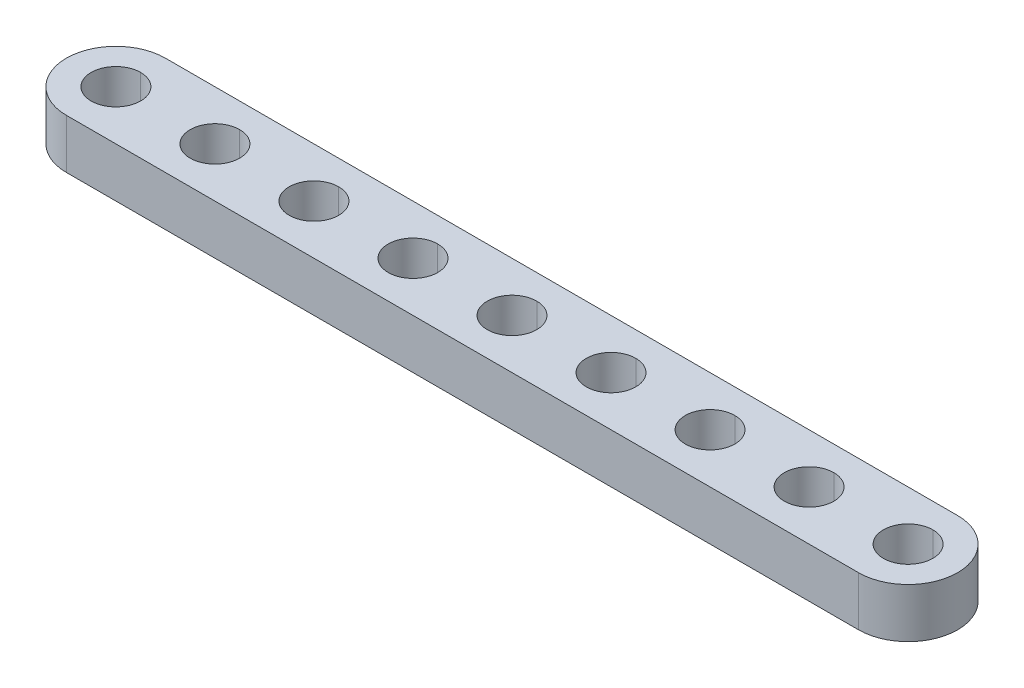
ISO-10303-21;
HEADER;
FILE_DESCRIPTION(('STEP AP214'),'2;1');
FILE_NAME('part.step','',(''),(''),'','','');
FILE_SCHEMA(('AUTOMOTIVE_DESIGN { 1 0 10303 214 1 1 1 1 }'));
ENDSEC;
DATA;
#1=APPLICATION_CONTEXT('core data for automotive mechanical design processes');
#2=APPLICATION_PROTOCOL_DEFINITION('international standard','automotive_design',2000,#1);
#3=PRODUCT_CONTEXT('',#1,'mechanical');
#4=PRODUCT('Part','Part','',(#3));
#5=PRODUCT_RELATED_PRODUCT_CATEGORY('part','',(#4));
#6=PRODUCT_DEFINITION_FORMATION('','',#4);
#7=PRODUCT_DEFINITION_CONTEXT('part definition',#1,'design');
#8=PRODUCT_DEFINITION('design','',#6,#7);
#9=PRODUCT_DEFINITION_SHAPE('','',#8);
#10=(LENGTH_UNIT() NAMED_UNIT(*) SI_UNIT(.MILLI.,.METRE.));
#11=(NAMED_UNIT(*) PLANE_ANGLE_UNIT() SI_UNIT($,.RADIAN.));
#12=(NAMED_UNIT(*) SI_UNIT($,.STERADIAN.) SOLID_ANGLE_UNIT());
#13=UNCERTAINTY_MEASURE_WITH_UNIT(LENGTH_MEASURE(1.E-05),#10,'distance_accuracy_value','');
#14=(GEOMETRIC_REPRESENTATION_CONTEXT(3) GLOBAL_UNCERTAINTY_ASSIGNED_CONTEXT((#13)) GLOBAL_UNIT_ASSIGNED_CONTEXT((#10,
#11,#12)) REPRESENTATION_CONTEXT('',''));
#15=CARTESIAN_POINT('',(0.,0.,0.));
#16=DIRECTION('',(0.,0.,1.));
#17=DIRECTION('',(1.,0.,0.));
#18=AXIS2_PLACEMENT_3D('',#15,#16,#17);
#19=CARTESIAN_POINT('',(32.,4.,0.));
#20=DIRECTION('',(0.,1.,0.));
#21=DIRECTION('',(0.,0.,1.));
#22=AXIS2_PLACEMENT_3D('',#19,#20,#21);
#23=CYLINDRICAL_SURFACE('',#22,2.);
#24=DIRECTION('',(0.,1.,0.));
#25=VECTOR('',#24,1.);
#26=CARTESIAN_POINT('',(32.,4.,-2.));
#27=LINE('',#26,#25);
#28=CARTESIAN_POINT('',(32.,0.,-2.));
#29=VERTEX_POINT('',#28);
#30=CARTESIAN_POINT('',(32.,4.,-2.));
#31=VERTEX_POINT('',#30);
#32=EDGE_CURVE('E288',#29,#31,#27,.T.);
#33=ORIENTED_EDGE('',*,*,#32,.F.);
#34=CARTESIAN_POINT('',(32.,0.,0.));
#35=DIRECTION('',(0.,1.,0.));
#36=DIRECTION('',(0.,0.,1.));
#37=AXIS2_PLACEMENT_3D('',#34,#35,#36);
#38=CIRCLE('',#37,2.);
#39=CARTESIAN_POINT('',(32.,0.,2.));
#40=VERTEX_POINT('',#39);
#41=EDGE_CURVE('E210',#40,#29,#38,.T.);
#42=ORIENTED_EDGE('',*,*,#41,.F.);
#43=DIRECTION('',(0.,1.,0.));
#44=VECTOR('',#43,1.);
#45=CARTESIAN_POINT('',(32.,4.,2.));
#46=LINE('',#45,#44);
#47=CARTESIAN_POINT('',(32.,4.,2.));
#48=VERTEX_POINT('',#47);
#49=EDGE_CURVE('E339',#40,#48,#46,.T.);
#50=ORIENTED_EDGE('',*,*,#49,.T.);
#51=CARTESIAN_POINT('',(32.,4.,0.));
#52=DIRECTION('',(0.,1.,0.));
#53=DIRECTION('',(0.,0.,1.));
#54=AXIS2_PLACEMENT_3D('',#51,#52,#53);
#55=CIRCLE('',#54,2.);
#56=EDGE_CURVE('E186',#48,#31,#55,.T.);
#57=ORIENTED_EDGE('',*,*,#56,.T.);
#58=EDGE_LOOP('',(#33,#42,#50,#57));
#59=FACE_BOUND('',#58,.T.);
#60=ADVANCED_FACE('F17',(#59),#23,.F.);
#61=CARTESIAN_POINT('',(24.,4.,0.));
#62=DIRECTION('',(0.,1.,0.));
#63=DIRECTION('',(0.,0.,1.));
#64=AXIS2_PLACEMENT_3D('',#61,#62,#63);
#65=CYLINDRICAL_SURFACE('',#64,2.);
#66=DIRECTION('',(0.,1.,0.));
#67=VECTOR('',#66,1.);
#68=CARTESIAN_POINT('',(24.,4.,-2.));
#69=LINE('',#68,#67);
#70=CARTESIAN_POINT('',(24.,0.,-2.));
#71=VERTEX_POINT('',#70);
#72=CARTESIAN_POINT('',(24.,4.,-2.));
#73=VERTEX_POINT('',#72);
#74=EDGE_CURVE('E324',#71,#73,#69,.T.);
#75=ORIENTED_EDGE('',*,*,#74,.F.);
#76=CARTESIAN_POINT('',(24.,0.,0.));
#77=DIRECTION('',(0.,1.,0.));
#78=DIRECTION('',(0.,0.,1.));
#79=AXIS2_PLACEMENT_3D('',#76,#77,#78);
#80=CIRCLE('',#79,2.);
#81=CARTESIAN_POINT('',(24.,0.,2.));
#82=VERTEX_POINT('',#81);
#83=EDGE_CURVE('E172',#82,#71,#80,.T.);
#84=ORIENTED_EDGE('',*,*,#83,.F.);
#85=DIRECTION('',(0.,1.,0.));
#86=VECTOR('',#85,1.);
#87=CARTESIAN_POINT('',(24.,4.,2.));
#88=LINE('',#87,#86);
#89=CARTESIAN_POINT('',(24.,4.,2.));
#90=VERTEX_POINT('',#89);
#91=EDGE_CURVE('E248',#82,#90,#88,.T.);
#92=ORIENTED_EDGE('',*,*,#91,.T.);
#93=CARTESIAN_POINT('',(24.,4.,0.));
#94=DIRECTION('',(0.,1.,0.));
#95=DIRECTION('',(0.,0.,1.));
#96=AXIS2_PLACEMENT_3D('',#93,#94,#95);
#97=CIRCLE('',#96,2.);
#98=EDGE_CURVE('E273',#90,#73,#97,.T.);
#99=ORIENTED_EDGE('',*,*,#98,.T.);
#100=EDGE_LOOP('',(#75,#84,#92,#99));
#101=FACE_BOUND('',#100,.T.);
#102=ADVANCED_FACE('F473',(#101),#65,.F.);
#103=CARTESIAN_POINT('',(16.,4.,0.));
#104=DIRECTION('',(0.,1.,0.));
#105=DIRECTION('',(0.,0.,1.));
#106=AXIS2_PLACEMENT_3D('',#103,#104,#105);
#107=CYLINDRICAL_SURFACE('',#106,2.);
#108=DIRECTION('',(0.,1.,0.));
#109=VECTOR('',#108,1.);
#110=CARTESIAN_POINT('',(16.,4.,-2.));
#111=LINE('',#110,#109);
#112=CARTESIAN_POINT('',(16.,0.,-2.));
#113=VERTEX_POINT('',#112);
#114=CARTESIAN_POINT('',(16.,4.,-2.));
#115=VERTEX_POINT('',#114);
#116=EDGE_CURVE('E238',#113,#115,#111,.T.);
#117=ORIENTED_EDGE('',*,*,#116,.F.);
#118=CARTESIAN_POINT('',(16.,0.,0.));
#119=DIRECTION('',(0.,1.,0.));
#120=DIRECTION('',(0.,0.,1.));
#121=AXIS2_PLACEMENT_3D('',#118,#119,#120);
#122=CIRCLE('',#121,2.);
#123=CARTESIAN_POINT('',(16.,0.,2.));
#124=VERTEX_POINT('',#123);
#125=EDGE_CURVE('E228',#124,#113,#122,.T.);
#126=ORIENTED_EDGE('',*,*,#125,.F.);
#127=DIRECTION('',(0.,1.,0.));
#128=VECTOR('',#127,1.);
#129=CARTESIAN_POINT('',(16.,4.,2.));
#130=LINE('',#129,#128);
#131=CARTESIAN_POINT('',(16.,4.,2.));
#132=VERTEX_POINT('',#131);
#133=EDGE_CURVE('E246',#124,#132,#130,.T.);
#134=ORIENTED_EDGE('',*,*,#133,.T.);
#135=CARTESIAN_POINT('',(16.,4.,0.));
#136=DIRECTION('',(0.,1.,0.));
#137=DIRECTION('',(0.,0.,1.));
#138=AXIS2_PLACEMENT_3D('',#135,#136,#137);
#139=CIRCLE('',#138,2.);
#140=EDGE_CURVE('E133',#132,#115,#139,.T.);
#141=ORIENTED_EDGE('',*,*,#140,.T.);
#142=EDGE_LOOP('',(#117,#126,#134,#141));
#143=FACE_BOUND('',#142,.T.);
#144=ADVANCED_FACE('F239',(#143),#107,.F.);
#145=CARTESIAN_POINT('',(8.,4.,0.));
#146=DIRECTION('',(0.,1.,0.));
#147=DIRECTION('',(0.,0.,1.));
#148=AXIS2_PLACEMENT_3D('',#145,#146,#147);
#149=CYLINDRICAL_SURFACE('',#148,2.);
#150=DIRECTION('',(0.,1.,0.));
#151=VECTOR('',#150,1.);
#152=CARTESIAN_POINT('',(8.,4.,-2.));
#153=LINE('',#152,#151);
#154=CARTESIAN_POINT('',(8.,0.,-2.));
#155=VERTEX_POINT('',#154);
#156=CARTESIAN_POINT('',(8.,4.,-2.));
#157=VERTEX_POINT('',#156);
#158=EDGE_CURVE('E355',#155,#157,#153,.T.);
#159=ORIENTED_EDGE('',*,*,#158,.F.);
#160=CARTESIAN_POINT('',(8.,0.,0.));
#161=DIRECTION('',(0.,1.,0.));
#162=DIRECTION('',(0.,0.,1.));
#163=AXIS2_PLACEMENT_3D('',#160,#161,#162);
#164=CIRCLE('',#163,2.);
#165=CARTESIAN_POINT('',(8.,0.,2.));
#166=VERTEX_POINT('',#165);
#167=EDGE_CURVE('E120',#166,#155,#164,.T.);
#168=ORIENTED_EDGE('',*,*,#167,.F.);
#169=DIRECTION('',(0.,1.,0.));
#170=VECTOR('',#169,1.);
#171=CARTESIAN_POINT('',(8.,4.,2.));
#172=LINE('',#171,#170);
#173=CARTESIAN_POINT('',(8.,4.,2.));
#174=VERTEX_POINT('',#173);
#175=EDGE_CURVE('E274',#166,#174,#172,.T.);
#176=ORIENTED_EDGE('',*,*,#175,.T.);
#177=CARTESIAN_POINT('',(8.,4.,0.));
#178=DIRECTION('',(0.,1.,0.));
#179=DIRECTION('',(0.,0.,1.));
#180=AXIS2_PLACEMENT_3D('',#177,#178,#179);
#181=CIRCLE('',#180,2.);
#182=EDGE_CURVE('E300',#174,#157,#181,.T.);
#183=ORIENTED_EDGE('',*,*,#182,.T.);
#184=EDGE_LOOP('',(#159,#168,#176,#183));
#185=FACE_BOUND('',#184,.T.);
#186=ADVANCED_FACE('F516',(#185),#149,.F.);
#187=CARTESIAN_POINT('',(0.,4.,0.));
#188=DIRECTION('',(0.,1.,0.));
#189=DIRECTION('',(0.,0.,1.));
#190=AXIS2_PLACEMENT_3D('',#187,#188,#189);
#191=CYLINDRICAL_SURFACE('',#190,2.);
#192=DIRECTION('',(0.,1.,0.));
#193=VECTOR('',#192,1.);
#194=CARTESIAN_POINT('',(0.,4.,-2.));
#195=LINE('',#194,#193);
#196=CARTESIAN_POINT('',(0.,0.,-2.));
#197=VERTEX_POINT('',#196);
#198=CARTESIAN_POINT('',(0.,4.,-2.));
#199=VERTEX_POINT('',#198);
#200=EDGE_CURVE('E316',#197,#199,#195,.T.);
#201=ORIENTED_EDGE('',*,*,#200,.F.);
#202=CARTESIAN_POINT('',(0.,0.,0.));
#203=DIRECTION('',(0.,1.,0.));
#204=DIRECTION('',(0.,0.,1.));
#205=AXIS2_PLACEMENT_3D('',#202,#203,#204);
#206=CIRCLE('',#205,2.);
#207=CARTESIAN_POINT('',(0.,0.,2.));
#208=VERTEX_POINT('',#207);
#209=EDGE_CURVE('E266',#208,#197,#206,.T.);
#210=ORIENTED_EDGE('',*,*,#209,.F.);
#211=DIRECTION('',(0.,1.,0.));
#212=VECTOR('',#211,1.);
#213=CARTESIAN_POINT('',(0.,4.,2.));
#214=LINE('',#213,#212);
#215=CARTESIAN_POINT('',(0.,4.,2.));
#216=VERTEX_POINT('',#215);
#217=EDGE_CURVE('E265',#208,#216,#214,.T.);
#218=ORIENTED_EDGE('',*,*,#217,.T.);
#219=CARTESIAN_POINT('',(0.,4.,0.));
#220=DIRECTION('',(0.,1.,0.));
#221=DIRECTION('',(0.,0.,1.));
#222=AXIS2_PLACEMENT_3D('',#219,#220,#221);
#223=CIRCLE('',#222,2.);
#224=EDGE_CURVE('E303',#216,#199,#223,.T.);
#225=ORIENTED_EDGE('',*,*,#224,.T.);
#226=EDGE_LOOP('',(#201,#210,#218,#225));
#227=FACE_BOUND('',#226,.T.);
#228=ADVANCED_FACE('F518',(#227),#191,.F.);
#229=CARTESIAN_POINT('',(-8.,4.,0.));
#230=DIRECTION('',(0.,1.,0.));
#231=DIRECTION('',(0.,0.,1.));
#232=AXIS2_PLACEMENT_3D('',#229,#230,#231);
#233=CYLINDRICAL_SURFACE('',#232,2.);
#234=DIRECTION('',(0.,1.,0.));
#235=VECTOR('',#234,1.);
#236=CARTESIAN_POINT('',(-8.,4.,-2.));
#237=LINE('',#236,#235);
#238=CARTESIAN_POINT('',(-8.,0.,-2.));
#239=VERTEX_POINT('',#238);
#240=CARTESIAN_POINT('',(-8.,4.,-2.));
#241=VERTEX_POINT('',#240);
#242=EDGE_CURVE('E264',#239,#241,#237,.T.);
#243=ORIENTED_EDGE('',*,*,#242,.F.);
#244=CARTESIAN_POINT('',(-8.,0.,0.));
#245=DIRECTION('',(0.,1.,0.));
#246=DIRECTION('',(0.,0.,1.));
#247=AXIS2_PLACEMENT_3D('',#244,#245,#246);
#248=CIRCLE('',#247,2.);
#249=CARTESIAN_POINT('',(-8.,0.,2.));
#250=VERTEX_POINT('',#249);
#251=EDGE_CURVE('E270',#250,#239,#248,.T.);
#252=ORIENTED_EDGE('',*,*,#251,.F.);
#253=DIRECTION('',(0.,1.,0.));
#254=VECTOR('',#253,1.);
#255=CARTESIAN_POINT('',(-8.,4.,2.));
#256=LINE('',#255,#254);
#257=CARTESIAN_POINT('',(-8.,4.,2.));
#258=VERTEX_POINT('',#257);
#259=EDGE_CURVE('E293',#250,#258,#256,.T.);
#260=ORIENTED_EDGE('',*,*,#259,.T.);
#261=CARTESIAN_POINT('',(-8.,4.,0.));
#262=DIRECTION('',(0.,1.,0.));
#263=DIRECTION('',(0.,0.,1.));
#264=AXIS2_PLACEMENT_3D('',#261,#262,#263);
#265=CIRCLE('',#264,2.);
#266=EDGE_CURVE('E395',#258,#241,#265,.T.);
#267=ORIENTED_EDGE('',*,*,#266,.T.);
#268=EDGE_LOOP('',(#243,#252,#260,#267));
#269=FACE_BOUND('',#268,.T.);
#270=ADVANCED_FACE('F512',(#269),#233,.F.);
#271=CARTESIAN_POINT('',(-16.,4.,0.));
#272=DIRECTION('',(0.,1.,0.));
#273=DIRECTION('',(0.,0.,1.));
#274=AXIS2_PLACEMENT_3D('',#271,#272,#273);
#275=CYLINDRICAL_SURFACE('',#274,2.);
#276=DIRECTION('',(0.,1.,0.));
#277=VECTOR('',#276,1.);
#278=CARTESIAN_POINT('',(-16.,4.,-2.));
#279=LINE('',#278,#277);
#280=CARTESIAN_POINT('',(-16.,0.,-2.));
#281=VERTEX_POINT('',#280);
#282=CARTESIAN_POINT('',(-16.,4.,-2.));
#283=VERTEX_POINT('',#282);
#284=EDGE_CURVE('E409',#281,#283,#279,.T.);
#285=ORIENTED_EDGE('',*,*,#284,.F.);
#286=CARTESIAN_POINT('',(-16.,0.,0.));
#287=DIRECTION('',(0.,1.,0.));
#288=DIRECTION('',(0.,0.,1.));
#289=AXIS2_PLACEMENT_3D('',#286,#287,#288);
#290=CIRCLE('',#289,2.);
#291=CARTESIAN_POINT('',(-16.,0.,2.));
#292=VERTEX_POINT('',#291);
#293=EDGE_CURVE('E310',#292,#281,#290,.T.);
#294=ORIENTED_EDGE('',*,*,#293,.F.);
#295=DIRECTION('',(0.,1.,0.));
#296=VECTOR('',#295,1.);
#297=CARTESIAN_POINT('',(-16.,4.,2.));
#298=LINE('',#297,#296);
#299=CARTESIAN_POINT('',(-16.,4.,2.));
#300=VERTEX_POINT('',#299);
#301=EDGE_CURVE('E422',#292,#300,#298,.T.);
#302=ORIENTED_EDGE('',*,*,#301,.T.);
#303=CARTESIAN_POINT('',(-16.,4.,0.));
#304=DIRECTION('',(0.,1.,0.));
#305=DIRECTION('',(0.,0.,1.));
#306=AXIS2_PLACEMENT_3D('',#303,#304,#305);
#307=CIRCLE('',#306,2.);
#308=EDGE_CURVE('E392',#300,#283,#307,.T.);
#309=ORIENTED_EDGE('',*,*,#308,.T.);
#310=EDGE_LOOP('',(#285,#294,#302,#309));
#311=FACE_BOUND('',#310,.T.);
#312=ADVANCED_FACE('F508',(#311),#275,.F.);
#313=CARTESIAN_POINT('',(-24.,4.,0.));
#314=DIRECTION('',(0.,1.,0.));
#315=DIRECTION('',(0.,0.,1.));
#316=AXIS2_PLACEMENT_3D('',#313,#314,#315);
#317=CYLINDRICAL_SURFACE('',#316,2.);
#318=DIRECTION('',(0.,1.,0.));
#319=VECTOR('',#318,1.);
#320=CARTESIAN_POINT('',(-24.,4.,-2.));
#321=LINE('',#320,#319);
#322=CARTESIAN_POINT('',(-24.,0.,-2.));
#323=VERTEX_POINT('',#322);
#324=CARTESIAN_POINT('',(-24.,4.,-2.));
#325=VERTEX_POINT('',#324);
#326=EDGE_CURVE('E304',#323,#325,#321,.T.);
#327=ORIENTED_EDGE('',*,*,#326,.F.);
#328=CARTESIAN_POINT('',(-24.,0.,0.));
#329=DIRECTION('',(0.,1.,0.));
#330=DIRECTION('',(0.,0.,1.));
#331=AXIS2_PLACEMENT_3D('',#328,#329,#330);
#332=CIRCLE('',#331,2.);
#333=CARTESIAN_POINT('',(-24.,0.,2.));
#334=VERTEX_POINT('',#333);
#335=EDGE_CURVE('E28',#334,#323,#332,.T.);
#336=ORIENTED_EDGE('',*,*,#335,.F.);
#337=DIRECTION('',(0.,1.,0.));
#338=VECTOR('',#337,1.);
#339=CARTESIAN_POINT('',(-24.,4.,2.));
#340=LINE('',#339,#338);
#341=CARTESIAN_POINT('',(-24.,4.,2.));
#342=VERTEX_POINT('',#341);
#343=EDGE_CURVE('E299',#334,#342,#340,.T.);
#344=ORIENTED_EDGE('',*,*,#343,.T.);
#345=CARTESIAN_POINT('',(-24.,4.,0.));
#346=DIRECTION('',(0.,1.,0.));
#347=DIRECTION('',(0.,0.,1.));
#348=AXIS2_PLACEMENT_3D('',#345,#346,#347);
#349=CIRCLE('',#348,2.);
#350=EDGE_CURVE('E379',#342,#325,#349,.T.);
#351=ORIENTED_EDGE('',*,*,#350,.T.);
#352=EDGE_LOOP('',(#327,#336,#344,#351));
#353=FACE_BOUND('',#352,.T.);
#354=ADVANCED_FACE('F511',(#353),#317,.F.);
#355=CARTESIAN_POINT('',(-32.,4.,0.));
#356=DIRECTION('',(0.,1.,0.));
#357=DIRECTION('',(0.,0.,1.));
#358=AXIS2_PLACEMENT_3D('',#355,#356,#357);
#359=CYLINDRICAL_SURFACE('',#358,2.);
#360=DIRECTION('',(0.,1.,0.));
#361=VECTOR('',#360,1.);
#362=CARTESIAN_POINT('',(-32.,4.,-2.));
#363=LINE('',#362,#361);
#364=CARTESIAN_POINT('',(-32.,0.,-2.));
#365=VERTEX_POINT('',#364);
#366=CARTESIAN_POINT('',(-32.,4.,-2.));
#367=VERTEX_POINT('',#366);
#368=EDGE_CURVE('E298',#365,#367,#363,.T.);
#369=ORIENTED_EDGE('',*,*,#368,.F.);
#370=CARTESIAN_POINT('',(-32.,0.,0.));
#371=DIRECTION('',(0.,1.,0.));
#372=DIRECTION('',(0.,0.,1.));
#373=AXIS2_PLACEMENT_3D('',#370,#371,#372);
#374=CIRCLE('',#373,2.);
#375=CARTESIAN_POINT('',(-32.,0.,2.));
#376=VERTEX_POINT('',#375);
#377=EDGE_CURVE('E9',#376,#365,#374,.T.);
#378=ORIENTED_EDGE('',*,*,#377,.F.);
#379=DIRECTION('',(0.,1.,0.));
#380=VECTOR('',#379,1.);
#381=CARTESIAN_POINT('',(-32.,4.,2.));
#382=LINE('',#381,#380);
#383=CARTESIAN_POINT('',(-32.,4.,2.));
#384=VERTEX_POINT('',#383);
#385=EDGE_CURVE('E21',#376,#384,#382,.T.);
#386=ORIENTED_EDGE('',*,*,#385,.T.);
#387=CARTESIAN_POINT('',(-32.,4.,0.));
#388=DIRECTION('',(0.,1.,0.));
#389=DIRECTION('',(0.,0.,1.));
#390=AXIS2_PLACEMENT_3D('',#387,#388,#389);
#391=CIRCLE('',#390,2.);
#392=EDGE_CURVE('E375',#384,#367,#391,.T.);
#393=ORIENTED_EDGE('',*,*,#392,.T.);
#394=EDGE_LOOP('',(#369,#378,#386,#393));
#395=FACE_BOUND('',#394,.T.);
#396=ADVANCED_FACE('F591',(#395),#359,.F.);
#397=CARTESIAN_POINT('',(-32.,0.,0.));
#398=DIRECTION('',(0.,1.,0.));
#399=DIRECTION('',(1.,0.,0.));
#400=AXIS2_PLACEMENT_3D('',#397,#398,#399);
#401=PLANE('',#400);
#402=ORIENTED_EDGE('',*,*,#377,.T.);
#403=CARTESIAN_POINT('',(-32.,0.,0.));
#404=DIRECTION('',(0.,1.,0.));
#405=DIRECTION('',(0.,0.,1.));
#406=AXIS2_PLACEMENT_3D('',#403,#404,#405);
#407=CIRCLE('',#406,2.);
#408=EDGE_CURVE('E294',#365,#376,#407,.T.);
#409=ORIENTED_EDGE('',*,*,#408,.T.);
#410=EDGE_LOOP('',(#402,#409));
#411=FACE_BOUND('',#410,.T.);
#412=ORIENTED_EDGE('',*,*,#335,.T.);
#413=CARTESIAN_POINT('',(-24.,0.,0.));
#414=DIRECTION('',(0.,1.,0.));
#415=DIRECTION('',(0.,0.,1.));
#416=AXIS2_PLACEMENT_3D('',#413,#414,#415);
#417=CIRCLE('',#416,2.);
#418=EDGE_CURVE('E309',#323,#334,#417,.T.);
#419=ORIENTED_EDGE('',*,*,#418,.T.);
#420=EDGE_LOOP('',(#412,#419));
#421=FACE_BOUND('',#420,.T.);
#422=ORIENTED_EDGE('',*,*,#293,.T.);
#423=CARTESIAN_POINT('',(-16.,0.,0.));
#424=DIRECTION('',(0.,1.,0.));
#425=DIRECTION('',(0.,0.,1.));
#426=AXIS2_PLACEMENT_3D('',#423,#424,#425);
#427=CIRCLE('',#426,2.);
#428=EDGE_CURVE('E260',#281,#292,#427,.T.);
#429=ORIENTED_EDGE('',*,*,#428,.T.);
#430=EDGE_LOOP('',(#422,#429));
#431=FACE_BOUND('',#430,.T.);
#432=ORIENTED_EDGE('',*,*,#251,.T.);
#433=CARTESIAN_POINT('',(-8.,0.,0.));
#434=DIRECTION('',(0.,1.,0.));
#435=DIRECTION('',(0.,0.,1.));
#436=AXIS2_PLACEMENT_3D('',#433,#434,#435);
#437=CIRCLE('',#436,2.);
#438=EDGE_CURVE('E261',#239,#250,#437,.T.);
#439=ORIENTED_EDGE('',*,*,#438,.T.);
#440=EDGE_LOOP('',(#432,#439));
#441=FACE_BOUND('',#440,.T.);
#442=ORIENTED_EDGE('',*,*,#209,.T.);
#443=CARTESIAN_POINT('',(0.,0.,0.));
#444=DIRECTION('',(0.,1.,0.));
#445=DIRECTION('',(0.,0.,1.));
#446=AXIS2_PLACEMENT_3D('',#443,#444,#445);
#447=CIRCLE('',#446,2.);
#448=EDGE_CURVE('E278',#197,#208,#447,.T.);
#449=ORIENTED_EDGE('',*,*,#448,.T.);
#450=EDGE_LOOP('',(#442,#449));
#451=FACE_BOUND('',#450,.T.);
#452=ORIENTED_EDGE('',*,*,#167,.T.);
#453=CARTESIAN_POINT('',(8.,0.,0.));
#454=DIRECTION('',(0.,1.,0.));
#455=DIRECTION('',(0.,0.,1.));
#456=AXIS2_PLACEMENT_3D('',#453,#454,#455);
#457=CIRCLE('',#456,2.);
#458=EDGE_CURVE('E352',#155,#166,#457,.T.);
#459=ORIENTED_EDGE('',*,*,#458,.T.);
#460=EDGE_LOOP('',(#452,#459));
#461=FACE_BOUND('',#460,.T.);
#462=ORIENTED_EDGE('',*,*,#125,.T.);
#463=CARTESIAN_POINT('',(16.,0.,0.));
#464=DIRECTION('',(0.,1.,0.));
#465=DIRECTION('',(0.,0.,1.));
#466=AXIS2_PLACEMENT_3D('',#463,#464,#465);
#467=CIRCLE('',#466,2.);
#468=EDGE_CURVE('E232',#113,#124,#467,.T.);
#469=ORIENTED_EDGE('',*,*,#468,.T.);
#470=EDGE_LOOP('',(#462,#469));
#471=FACE_BOUND('',#470,.T.);
#472=ORIENTED_EDGE('',*,*,#83,.T.);
#473=CARTESIAN_POINT('',(24.,0.,0.));
#474=DIRECTION('',(0.,1.,0.));
#475=DIRECTION('',(0.,0.,1.));
#476=AXIS2_PLACEMENT_3D('',#473,#474,#475);
#477=CIRCLE('',#476,2.);
#478=EDGE_CURVE('E342',#71,#82,#477,.T.);
#479=ORIENTED_EDGE('',*,*,#478,.T.);
#480=EDGE_LOOP('',(#472,#479));
#481=FACE_BOUND('',#480,.T.);
#482=ORIENTED_EDGE('',*,*,#41,.T.);
#483=CARTESIAN_POINT('',(32.,0.,0.));
#484=DIRECTION('',(0.,1.,0.));
#485=DIRECTION('',(0.,0.,1.));
#486=AXIS2_PLACEMENT_3D('',#483,#484,#485);
#487=CIRCLE('',#486,2.);
#488=EDGE_CURVE('E285',#29,#40,#487,.T.);
#489=ORIENTED_EDGE('',*,*,#488,.T.);
#490=EDGE_LOOP('',(#482,#489));
#491=FACE_BOUND('',#490,.T.);
#492=CARTESIAN_POINT('',(-32.,0.,0.));
#493=DIRECTION('',(0.,1.,0.));
#494=DIRECTION('',(0.,0.,1.));
#495=AXIS2_PLACEMENT_3D('',#492,#493,#494);
#496=CIRCLE('',#495,4.);
#497=CARTESIAN_POINT('',(-32.,0.,-4.));
#498=VERTEX_POINT('',#497);
#499=CARTESIAN_POINT('',(-32.,0.,4.));
#500=VERTEX_POINT('',#499);
#501=EDGE_CURVE('E383',#498,#500,#496,.T.);
#502=ORIENTED_EDGE('',*,*,#501,.F.);
#503=DIRECTION('',(-1.,0.,0.));
#504=VECTOR('',#503,1.);
#505=CARTESIAN_POINT('',(-32.,0.,-4.));
#506=LINE('',#505,#504);
#507=CARTESIAN_POINT('',(32.,0.,-4.));
#508=VERTEX_POINT('',#507);
#509=EDGE_CURVE('E334',#508,#498,#506,.T.);
#510=ORIENTED_EDGE('',*,*,#509,.F.);
#511=CARTESIAN_POINT('',(32.,0.,0.));
#512=DIRECTION('',(0.,1.,0.));
#513=DIRECTION('',(0.,0.,1.));
#514=AXIS2_PLACEMENT_3D('',#511,#512,#513);
#515=CIRCLE('',#514,4.);
#516=CARTESIAN_POINT('',(32.,0.,4.));
#517=VERTEX_POINT('',#516);
#518=EDGE_CURVE('E284',#517,#508,#515,.T.);
#519=ORIENTED_EDGE('',*,*,#518,.F.);
#520=DIRECTION('',(1.,0.,0.));
#521=VECTOR('',#520,1.);
#522=CARTESIAN_POINT('',(-32.,0.,4.));
#523=LINE('',#522,#521);
#524=EDGE_CURVE('E344',#500,#517,#523,.T.);
#525=ORIENTED_EDGE('',*,*,#524,.F.);
#526=EDGE_LOOP('',(#502,#510,#519,#525));
#527=FACE_BOUND('',#526,.T.);
#528=ADVANCED_FACE('F230',(#411,#421,#431,#441,#451,#461,#471,#481,#491,#527),#401,.F.);
#529=CARTESIAN_POINT('',(-32.,4.,0.));
#530=DIRECTION('',(0.,1.,0.));
#531=DIRECTION('',(1.,0.,0.));
#532=AXIS2_PLACEMENT_3D('',#529,#530,#531);
#533=PLANE('',#532);
#534=ORIENTED_EDGE('',*,*,#392,.F.);
#535=CARTESIAN_POINT('',(-32.,4.,0.));
#536=DIRECTION('',(0.,1.,0.));
#537=DIRECTION('',(0.,0.,1.));
#538=AXIS2_PLACEMENT_3D('',#535,#536,#537);
#539=CIRCLE('',#538,2.);
#540=EDGE_CURVE('E399',#367,#384,#539,.T.);
#541=ORIENTED_EDGE('',*,*,#540,.F.);
#542=EDGE_LOOP('',(#534,#541));
#543=FACE_BOUND('',#542,.T.);
#544=ORIENTED_EDGE('',*,*,#350,.F.);
#545=CARTESIAN_POINT('',(-24.,4.,0.));
#546=DIRECTION('',(0.,1.,0.));
#547=DIRECTION('',(0.,0.,1.));
#548=AXIS2_PLACEMENT_3D('',#545,#546,#547);
#549=CIRCLE('',#548,2.);
#550=EDGE_CURVE('E308',#325,#342,#549,.T.);
#551=ORIENTED_EDGE('',*,*,#550,.F.);
#552=EDGE_LOOP('',(#544,#551));
#553=FACE_BOUND('',#552,.T.);
#554=ORIENTED_EDGE('',*,*,#308,.F.);
#555=CARTESIAN_POINT('',(-16.,4.,0.));
#556=DIRECTION('',(0.,1.,0.));
#557=DIRECTION('',(0.,0.,1.));
#558=AXIS2_PLACEMENT_3D('',#555,#556,#557);
#559=CIRCLE('',#558,2.);
#560=EDGE_CURVE('E413',#283,#300,#559,.T.);
#561=ORIENTED_EDGE('',*,*,#560,.F.);
#562=EDGE_LOOP('',(#554,#561));
#563=FACE_BOUND('',#562,.T.);
#564=ORIENTED_EDGE('',*,*,#266,.F.);
#565=CARTESIAN_POINT('',(-8.,4.,0.));
#566=DIRECTION('',(0.,1.,0.));
#567=DIRECTION('',(0.,0.,1.));
#568=AXIS2_PLACEMENT_3D('',#565,#566,#567);
#569=CIRCLE('',#568,2.);
#570=EDGE_CURVE('E289',#241,#258,#569,.T.);
#571=ORIENTED_EDGE('',*,*,#570,.F.);
#572=EDGE_LOOP('',(#564,#571));
#573=FACE_BOUND('',#572,.T.);
#574=ORIENTED_EDGE('',*,*,#224,.F.);
#575=CARTESIAN_POINT('',(0.,4.,0.));
#576=DIRECTION('',(0.,1.,0.));
#577=DIRECTION('',(0.,0.,1.));
#578=AXIS2_PLACEMENT_3D('',#575,#576,#577);
#579=CIRCLE('',#578,2.);
#580=EDGE_CURVE('E320',#199,#216,#579,.T.);
#581=ORIENTED_EDGE('',*,*,#580,.F.);
#582=EDGE_LOOP('',(#574,#581));
#583=FACE_BOUND('',#582,.T.);
#584=ORIENTED_EDGE('',*,*,#182,.F.);
#585=CARTESIAN_POINT('',(8.,4.,0.));
#586=DIRECTION('',(0.,1.,0.));
#587=DIRECTION('',(0.,0.,1.));
#588=AXIS2_PLACEMENT_3D('',#585,#586,#587);
#589=CIRCLE('',#588,2.);
#590=EDGE_CURVE('E279',#157,#174,#589,.T.);
#591=ORIENTED_EDGE('',*,*,#590,.F.);
#592=EDGE_LOOP('',(#584,#591));
#593=FACE_BOUND('',#592,.T.);
#594=ORIENTED_EDGE('',*,*,#140,.F.);
#595=CARTESIAN_POINT('',(16.,4.,0.));
#596=DIRECTION('',(0.,1.,0.));
#597=DIRECTION('',(0.,0.,1.));
#598=AXIS2_PLACEMENT_3D('',#595,#596,#597);
#599=CIRCLE('',#598,2.);
#600=EDGE_CURVE('E243',#115,#132,#599,.T.);
#601=ORIENTED_EDGE('',*,*,#600,.F.);
#602=EDGE_LOOP('',(#594,#601));
#603=FACE_BOUND('',#602,.T.);
#604=ORIENTED_EDGE('',*,*,#98,.F.);
#605=CARTESIAN_POINT('',(24.,4.,0.));
#606=DIRECTION('',(0.,1.,0.));
#607=DIRECTION('',(0.,0.,1.));
#608=AXIS2_PLACEMENT_3D('',#605,#606,#607);
#609=CIRCLE('',#608,2.);
#610=EDGE_CURVE('E256',#73,#90,#609,.T.);
#611=ORIENTED_EDGE('',*,*,#610,.F.);
#612=EDGE_LOOP('',(#604,#611));
#613=FACE_BOUND('',#612,.T.);
#614=ORIENTED_EDGE('',*,*,#56,.F.);
#615=CARTESIAN_POINT('',(32.,4.,0.));
#616=DIRECTION('',(0.,1.,0.));
#617=DIRECTION('',(0.,0.,1.));
#618=AXIS2_PLACEMENT_3D('',#615,#616,#617);
#619=CIRCLE('',#618,2.);
#620=EDGE_CURVE('E343',#31,#48,#619,.T.);
#621=ORIENTED_EDGE('',*,*,#620,.F.);
#622=EDGE_LOOP('',(#614,#621));
#623=FACE_BOUND('',#622,.T.);
#624=CARTESIAN_POINT('',(-32.,4.,0.));
#625=DIRECTION('',(0.,1.,0.));
#626=DIRECTION('',(0.,0.,1.));
#627=AXIS2_PLACEMENT_3D('',#624,#625,#626);
#628=CIRCLE('',#627,4.);
#629=CARTESIAN_POINT('',(-32.,4.,-4.));
#630=VERTEX_POINT('',#629);
#631=CARTESIAN_POINT('',(-32.,4.,4.));
#632=VERTEX_POINT('',#631);
#633=EDGE_CURVE('E325',#630,#632,#628,.T.);
#634=ORIENTED_EDGE('',*,*,#633,.T.);
#635=DIRECTION('',(1.,0.,0.));
#636=VECTOR('',#635,1.);
#637=CARTESIAN_POINT('',(-32.,4.,4.));
#638=LINE('',#637,#636);
#639=CARTESIAN_POINT('',(32.,4.,4.));
#640=VERTEX_POINT('',#639);
#641=EDGE_CURVE('E371',#632,#640,#638,.T.);
#642=ORIENTED_EDGE('',*,*,#641,.T.);
#643=CARTESIAN_POINT('',(32.,4.,0.));
#644=DIRECTION('',(0.,1.,0.));
#645=DIRECTION('',(0.,0.,1.));
#646=AXIS2_PLACEMENT_3D('',#643,#644,#645);
#647=CIRCLE('',#646,4.);
#648=CARTESIAN_POINT('',(32.,4.,-4.));
#649=VERTEX_POINT('',#648);
#650=EDGE_CURVE('E283',#640,#649,#647,.T.);
#651=ORIENTED_EDGE('',*,*,#650,.T.);
#652=DIRECTION('',(-1.,0.,0.));
#653=VECTOR('',#652,1.);
#654=CARTESIAN_POINT('',(-32.,4.,-4.));
#655=LINE('',#654,#653);
#656=EDGE_CURVE('E43',#649,#630,#655,.T.);
#657=ORIENTED_EDGE('',*,*,#656,.T.);
#658=EDGE_LOOP('',(#634,#642,#651,#657));
#659=FACE_BOUND('',#658,.T.);
#660=ADVANCED_FACE('F475',(#543,#553,#563,#573,#583,#593,#603,#613,#623,#659),#533,.T.);
#661=CARTESIAN_POINT('',(-32.,4.,-4.));
#662=DIRECTION('',(0.,0.,1.));
#663=DIRECTION('',(1.,0.,0.));
#664=AXIS2_PLACEMENT_3D('',#661,#662,#663);
#665=PLANE('',#664);
#666=ORIENTED_EDGE('',*,*,#509,.T.);
#667=DIRECTION('',(0.,-1.,0.));
#668=VECTOR('',#667,1.);
#669=CARTESIAN_POINT('',(-32.,4.,-4.));
#670=LINE('',#669,#668);
#671=EDGE_CURVE('E329',#630,#498,#670,.T.);
#672=ORIENTED_EDGE('',*,*,#671,.F.);
#673=ORIENTED_EDGE('',*,*,#656,.F.);
#674=DIRECTION('',(0.,-1.,0.));
#675=VECTOR('',#674,1.);
#676=CARTESIAN_POINT('',(32.,4.,-4.));
#677=LINE('',#676,#675);
#678=EDGE_CURVE('E280',#649,#508,#677,.T.);
#679=ORIENTED_EDGE('',*,*,#678,.T.);
#680=EDGE_LOOP('',(#666,#672,#673,#679));
#681=FACE_BOUND('',#680,.T.);
#682=ADVANCED_FACE('F477',(#681),#665,.F.);
#683=CARTESIAN_POINT('',(32.,4.,0.));
#684=DIRECTION('',(0.,-1.,0.));
#685=DIRECTION('',(0.,0.,-1.));
#686=AXIS2_PLACEMENT_3D('',#683,#684,#685);
#687=CYLINDRICAL_SURFACE('',#686,4.);
#688=ORIENTED_EDGE('',*,*,#518,.T.);
#689=ORIENTED_EDGE('',*,*,#678,.F.);
#690=ORIENTED_EDGE('',*,*,#650,.F.);
#691=DIRECTION('',(0.,-1.,0.));
#692=VECTOR('',#691,1.);
#693=CARTESIAN_POINT('',(32.,4.,4.));
#694=LINE('',#693,#692);
#695=EDGE_CURVE('E348',#640,#517,#694,.T.);
#696=ORIENTED_EDGE('',*,*,#695,.T.);
#697=EDGE_LOOP('',(#688,#689,#690,#696));
#698=FACE_BOUND('',#697,.T.);
#699=ADVANCED_FACE('F491',(#698),#687,.T.);
#700=CARTESIAN_POINT('',(-32.,4.,4.));
#701=DIRECTION('',(0.,0.,-1.));
#702=DIRECTION('',(0.,-1.,0.));
#703=AXIS2_PLACEMENT_3D('',#700,#701,#702);
#704=PLANE('',#703);
#705=ORIENTED_EDGE('',*,*,#524,.T.);
#706=ORIENTED_EDGE('',*,*,#695,.F.);
#707=ORIENTED_EDGE('',*,*,#641,.F.);
#708=DIRECTION('',(0.,-1.,0.));
#709=VECTOR('',#708,1.);
#710=CARTESIAN_POINT('',(-32.,4.,4.));
#711=LINE('',#710,#709);
#712=EDGE_CURVE('E330',#632,#500,#711,.T.);
#713=ORIENTED_EDGE('',*,*,#712,.T.);
#714=EDGE_LOOP('',(#705,#706,#707,#713));
#715=FACE_BOUND('',#714,.T.);
#716=ADVANCED_FACE('F488',(#715),#704,.F.);
#717=CARTESIAN_POINT('',(-32.,4.,0.));
#718=DIRECTION('',(0.,-1.,0.));
#719=DIRECTION('',(0.,0.,-1.));
#720=AXIS2_PLACEMENT_3D('',#717,#718,#719);
#721=CYLINDRICAL_SURFACE('',#720,4.);
#722=ORIENTED_EDGE('',*,*,#501,.T.);
#723=ORIENTED_EDGE('',*,*,#712,.F.);
#724=ORIENTED_EDGE('',*,*,#633,.F.);
#725=ORIENTED_EDGE('',*,*,#671,.T.);
#726=EDGE_LOOP('',(#722,#723,#724,#725));
#727=FACE_BOUND('',#726,.T.);
#728=ADVANCED_FACE('F485',(#727),#721,.T.);
#729=CARTESIAN_POINT('',(-32.,4.,0.));
#730=DIRECTION('',(0.,1.,0.));
#731=DIRECTION('',(0.,0.,1.));
#732=AXIS2_PLACEMENT_3D('',#729,#730,#731);
#733=CYLINDRICAL_SURFACE('',#732,2.);
#734=ORIENTED_EDGE('',*,*,#408,.F.);
#735=ORIENTED_EDGE('',*,*,#368,.T.);
#736=ORIENTED_EDGE('',*,*,#540,.T.);
#737=ORIENTED_EDGE('',*,*,#385,.F.);
#738=EDGE_LOOP('',(#734,#735,#736,#737));
#739=FACE_BOUND('',#738,.T.);
#740=ADVANCED_FACE('F515',(#739),#733,.F.);
#741=CARTESIAN_POINT('',(-24.,4.,0.));
#742=DIRECTION('',(0.,1.,0.));
#743=DIRECTION('',(0.,0.,1.));
#744=AXIS2_PLACEMENT_3D('',#741,#742,#743);
#745=CYLINDRICAL_SURFACE('',#744,2.);
#746=ORIENTED_EDGE('',*,*,#418,.F.);
#747=ORIENTED_EDGE('',*,*,#326,.T.);
#748=ORIENTED_EDGE('',*,*,#550,.T.);
#749=ORIENTED_EDGE('',*,*,#343,.F.);
#750=EDGE_LOOP('',(#746,#747,#748,#749));
#751=FACE_BOUND('',#750,.T.);
#752=ADVANCED_FACE('F19',(#751),#745,.F.);
#753=CARTESIAN_POINT('',(-16.,4.,0.));
#754=DIRECTION('',(0.,1.,0.));
#755=DIRECTION('',(0.,0.,1.));
#756=AXIS2_PLACEMENT_3D('',#753,#754,#755);
#757=CYLINDRICAL_SURFACE('',#756,2.);
#758=ORIENTED_EDGE('',*,*,#428,.F.);
#759=ORIENTED_EDGE('',*,*,#284,.T.);
#760=ORIENTED_EDGE('',*,*,#560,.T.);
#761=ORIENTED_EDGE('',*,*,#301,.F.);
#762=EDGE_LOOP('',(#758,#759,#760,#761));
#763=FACE_BOUND('',#762,.T.);
#764=ADVANCED_FACE('F523',(#763),#757,.F.);
#765=CARTESIAN_POINT('',(-8.,4.,0.));
#766=DIRECTION('',(0.,1.,0.));
#767=DIRECTION('',(0.,0.,1.));
#768=AXIS2_PLACEMENT_3D('',#765,#766,#767);
#769=CYLINDRICAL_SURFACE('',#768,2.);
#770=ORIENTED_EDGE('',*,*,#438,.F.);
#771=ORIENTED_EDGE('',*,*,#242,.T.);
#772=ORIENTED_EDGE('',*,*,#570,.T.);
#773=ORIENTED_EDGE('',*,*,#259,.F.);
#774=EDGE_LOOP('',(#770,#771,#772,#773));
#775=FACE_BOUND('',#774,.T.);
#776=ADVANCED_FACE('F520',(#775),#769,.F.);
#777=CARTESIAN_POINT('',(0.,4.,0.));
#778=DIRECTION('',(0.,1.,0.));
#779=DIRECTION('',(0.,0.,1.));
#780=AXIS2_PLACEMENT_3D('',#777,#778,#779);
#781=CYLINDRICAL_SURFACE('',#780,2.);
#782=ORIENTED_EDGE('',*,*,#448,.F.);
#783=ORIENTED_EDGE('',*,*,#200,.T.);
#784=ORIENTED_EDGE('',*,*,#580,.T.);
#785=ORIENTED_EDGE('',*,*,#217,.F.);
#786=EDGE_LOOP('',(#782,#783,#784,#785));
#787=FACE_BOUND('',#786,.T.);
#788=ADVANCED_FACE('F522',(#787),#781,.F.);
#789=CARTESIAN_POINT('',(8.,4.,0.));
#790=DIRECTION('',(0.,1.,0.));
#791=DIRECTION('',(0.,0.,1.));
#792=AXIS2_PLACEMENT_3D('',#789,#790,#791);
#793=CYLINDRICAL_SURFACE('',#792,2.);
#794=ORIENTED_EDGE('',*,*,#458,.F.);
#795=ORIENTED_EDGE('',*,*,#158,.T.);
#796=ORIENTED_EDGE('',*,*,#590,.T.);
#797=ORIENTED_EDGE('',*,*,#175,.F.);
#798=EDGE_LOOP('',(#794,#795,#796,#797));
#799=FACE_BOUND('',#798,.T.);
#800=ADVANCED_FACE('F529',(#799),#793,.F.);
#801=CARTESIAN_POINT('',(16.,4.,0.));
#802=DIRECTION('',(0.,1.,0.));
#803=DIRECTION('',(0.,0.,1.));
#804=AXIS2_PLACEMENT_3D('',#801,#802,#803);
#805=CYLINDRICAL_SURFACE('',#804,2.);
#806=ORIENTED_EDGE('',*,*,#468,.F.);
#807=ORIENTED_EDGE('',*,*,#116,.T.);
#808=ORIENTED_EDGE('',*,*,#600,.T.);
#809=ORIENTED_EDGE('',*,*,#133,.F.);
#810=EDGE_LOOP('',(#806,#807,#808,#809));
#811=FACE_BOUND('',#810,.T.);
#812=ADVANCED_FACE('F245',(#811),#805,.F.);
#813=CARTESIAN_POINT('',(24.,4.,0.));
#814=DIRECTION('',(0.,1.,0.));
#815=DIRECTION('',(0.,0.,1.));
#816=AXIS2_PLACEMENT_3D('',#813,#814,#815);
#817=CYLINDRICAL_SURFACE('',#816,2.);
#818=ORIENTED_EDGE('',*,*,#478,.F.);
#819=ORIENTED_EDGE('',*,*,#74,.T.);
#820=ORIENTED_EDGE('',*,*,#610,.T.);
#821=ORIENTED_EDGE('',*,*,#91,.F.);
#822=EDGE_LOOP('',(#818,#819,#820,#821));
#823=FACE_BOUND('',#822,.T.);
#824=ADVANCED_FACE('F470',(#823),#817,.F.);
#825=CARTESIAN_POINT('',(32.,4.,0.));
#826=DIRECTION('',(0.,1.,0.));
#827=DIRECTION('',(0.,0.,1.));
#828=AXIS2_PLACEMENT_3D('',#825,#826,#827);
#829=CYLINDRICAL_SURFACE('',#828,2.);
#830=ORIENTED_EDGE('',*,*,#488,.F.);
#831=ORIENTED_EDGE('',*,*,#32,.T.);
#832=ORIENTED_EDGE('',*,*,#620,.T.);
#833=ORIENTED_EDGE('',*,*,#49,.F.);
#834=EDGE_LOOP('',(#830,#831,#832,#833));
#835=FACE_BOUND('',#834,.T.);
#836=ADVANCED_FACE('F506',(#835),#829,.F.);
#837=CLOSED_SHELL('',(#60,#102,#144,#186,#228,#270,#312,#354,#396,#528,#660,#682,#699,#716,#728,
#740,#752,#764,#776,#788,#800,#812,#824,#836));
#838=MANIFOLD_SOLID_BREP('B1',#837);
#839=ADVANCED_BREP_SHAPE_REPRESENTATION('',(#18,#838),#14);
#840=SHAPE_DEFINITION_REPRESENTATION(#9,#839);
ENDSEC;
END-ISO-10303-21;
